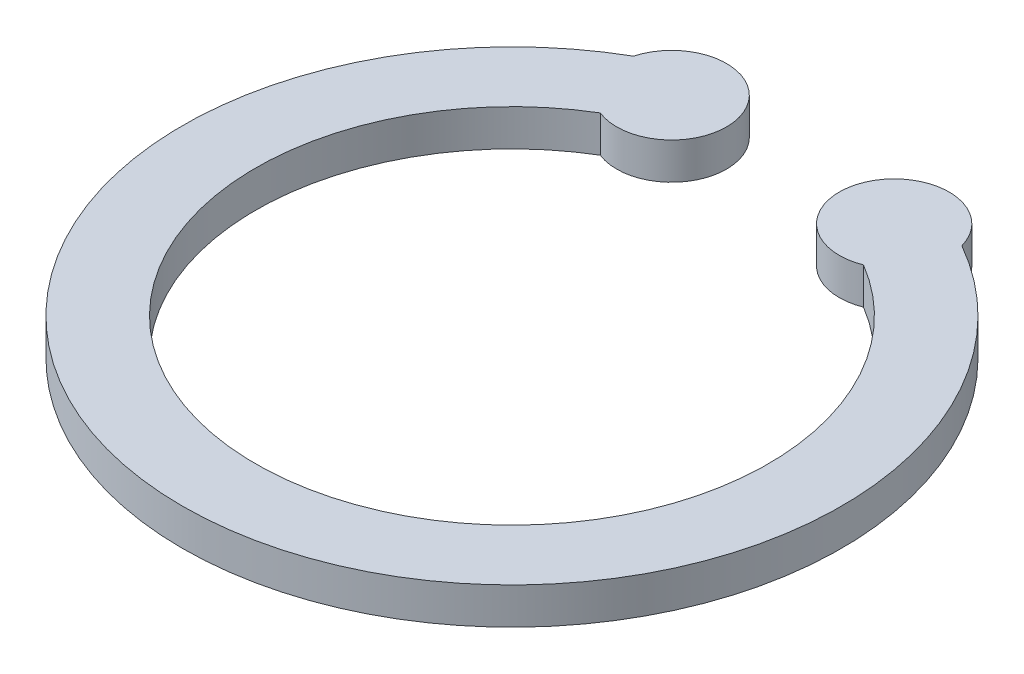
ISO-10303-21;
HEADER;
FILE_DESCRIPTION(('STEP AP214'),'2;1');
FILE_NAME('part.step','',(''),(''),'','','');
FILE_SCHEMA(('AUTOMOTIVE_DESIGN { 1 0 10303 214 1 1 1 1 }'));
ENDSEC;
DATA;
#1=APPLICATION_CONTEXT('core data for automotive mechanical design processes');
#2=APPLICATION_PROTOCOL_DEFINITION('international standard','automotive_design',2000,#1);
#3=PRODUCT_CONTEXT('',#1,'mechanical');
#4=PRODUCT('Part','Part','',(#3));
#5=PRODUCT_RELATED_PRODUCT_CATEGORY('part','',(#4));
#6=PRODUCT_DEFINITION_FORMATION('','',#4);
#7=PRODUCT_DEFINITION_CONTEXT('part definition',#1,'design');
#8=PRODUCT_DEFINITION('design','',#6,#7);
#9=PRODUCT_DEFINITION_SHAPE('','',#8);
#10=(LENGTH_UNIT() NAMED_UNIT(*) SI_UNIT(.MILLI.,.METRE.));
#11=(NAMED_UNIT(*) PLANE_ANGLE_UNIT() SI_UNIT($,.RADIAN.));
#12=(NAMED_UNIT(*) SI_UNIT($,.STERADIAN.) SOLID_ANGLE_UNIT());
#13=UNCERTAINTY_MEASURE_WITH_UNIT(LENGTH_MEASURE(1.E-05),#10,'distance_accuracy_value','');
#14=(GEOMETRIC_REPRESENTATION_CONTEXT(3) GLOBAL_UNCERTAINTY_ASSIGNED_CONTEXT((#13)) GLOBAL_UNIT_ASSIGNED_CONTEXT((#10,
#11,#12)) REPRESENTATION_CONTEXT('',''));
#15=CARTESIAN_POINT('',(0.,0.,0.));
#16=DIRECTION('',(0.,0.,1.));
#17=DIRECTION('',(1.,0.,0.));
#18=AXIS2_PLACEMENT_3D('',#15,#16,#17);
#19=CARTESIAN_POINT('',(-1.5195527568934,0.5,-3.70012964894714));
#20=DIRECTION('',(0.,-1.,0.));
#21=DIRECTION('',(0.,0.,-1.));
#22=AXIS2_PLACEMENT_3D('',#19,#20,#21);
#23=CYLINDRICAL_SURFACE('',#22,0.75);
#24=CARTESIAN_POINT('',(-1.5195527568934,0.,-3.70012964894714));
#25=DIRECTION('',(0.,1.,0.));
#26=DIRECTION('',(0.,0.,1.));
#27=AXIS2_PLACEMENT_3D('',#24,#25,#26);
#28=CIRCLE('',#27,0.75);
#29=CARTESIAN_POINT('',(-1.79712877821287,0.,-3.00338611479096));
#30=VERTEX_POINT('',#29);
#31=CARTESIAN_POINT('',(-2.24194265383014,0.,-3.9017551354406));
#32=VERTEX_POINT('',#31);
#33=EDGE_CURVE('E113',#30,#32,#28,.T.);
#34=ORIENTED_EDGE('',*,*,#33,.T.);
#35=DIRECTION('',(0.,-1.,0.));
#36=VECTOR('',#35,1.);
#37=CARTESIAN_POINT('',(-2.24194265383014,0.5,-3.9017551354406));
#38=LINE('',#37,#36);
#39=CARTESIAN_POINT('',(-2.24194265383014,0.5,-3.9017551354406));
#40=VERTEX_POINT('',#39);
#41=EDGE_CURVE('E11',#40,#32,#38,.T.);
#42=ORIENTED_EDGE('',*,*,#41,.F.);
#43=CARTESIAN_POINT('',(-1.5195527568934,0.5,-3.70012964894714));
#44=DIRECTION('',(0.,1.,0.));
#45=DIRECTION('',(0.,0.,1.));
#46=AXIS2_PLACEMENT_3D('',#43,#44,#45);
#47=CIRCLE('',#46,0.75);
#48=CARTESIAN_POINT('',(-1.79712877821287,0.5,-3.00338611479096));
#49=VERTEX_POINT('',#48);
#50=EDGE_CURVE('E97',#49,#40,#47,.T.);
#51=ORIENTED_EDGE('',*,*,#50,.F.);
#52=DIRECTION('',(0.,-1.,0.));
#53=VECTOR('',#52,1.);
#54=CARTESIAN_POINT('',(-1.79712877821287,0.5,-3.00338611479096));
#55=LINE('',#54,#53);
#56=EDGE_CURVE('E109',#49,#30,#55,.T.);
#57=ORIENTED_EDGE('',*,*,#56,.T.);
#58=EDGE_LOOP('',(#34,#42,#51,#57));
#59=FACE_BOUND('',#58,.T.);
#60=ADVANCED_FACE('F45',(#59),#23,.T.);
#61=CARTESIAN_POINT('',(0.,0.5,0.));
#62=DIRECTION('',(0.,-1.,0.));
#63=DIRECTION('',(0.,0.,-1.));
#64=AXIS2_PLACEMENT_3D('',#61,#62,#63);
#65=CYLINDRICAL_SURFACE('',#64,4.5);
#66=CARTESIAN_POINT('',(0.,0.,0.));
#67=DIRECTION('',(0.,1.,0.));
#68=DIRECTION('',(0.,0.,1.));
#69=AXIS2_PLACEMENT_3D('',#66,#67,#68);
#70=CIRCLE('',#69,4.5);
#71=CARTESIAN_POINT('',(2.24194265383014,0.,-3.9017551354406));
#72=VERTEX_POINT('',#71);
#73=EDGE_CURVE('E102',#32,#72,#70,.T.);
#74=ORIENTED_EDGE('',*,*,#73,.T.);
#75=DIRECTION('',(0.,-1.,0.));
#76=VECTOR('',#75,1.);
#77=CARTESIAN_POINT('',(2.24194265383014,0.5,-3.9017551354406));
#78=LINE('',#77,#76);
#79=CARTESIAN_POINT('',(2.24194265383014,0.5,-3.9017551354406));
#80=VERTEX_POINT('',#79);
#81=EDGE_CURVE('E54',#80,#72,#78,.T.);
#82=ORIENTED_EDGE('',*,*,#81,.F.);
#83=CARTESIAN_POINT('',(0.,0.5,0.));
#84=DIRECTION('',(0.,1.,0.));
#85=DIRECTION('',(0.,0.,1.));
#86=AXIS2_PLACEMENT_3D('',#83,#84,#85);
#87=CIRCLE('',#86,4.5);
#88=EDGE_CURVE('E92',#40,#80,#87,.T.);
#89=ORIENTED_EDGE('',*,*,#88,.F.);
#90=ORIENTED_EDGE('',*,*,#41,.T.);
#91=EDGE_LOOP('',(#74,#82,#89,#90));
#92=FACE_BOUND('',#91,.T.);
#93=ADVANCED_FACE('F101',(#92),#65,.T.);
#94=CARTESIAN_POINT('',(1.5195527568934,0.5,-3.70012964894714));
#95=DIRECTION('',(0.,-1.,0.));
#96=DIRECTION('',(0.,0.,-1.));
#97=AXIS2_PLACEMENT_3D('',#94,#95,#96);
#98=CYLINDRICAL_SURFACE('',#97,0.75);
#99=CARTESIAN_POINT('',(1.5195527568934,0.,-3.70012964894714));
#100=DIRECTION('',(0.,1.,0.));
#101=DIRECTION('',(0.,0.,1.));
#102=AXIS2_PLACEMENT_3D('',#99,#100,#101);
#103=CIRCLE('',#102,0.75);
#104=CARTESIAN_POINT('',(1.79712877821287,0.,-3.00338611479095));
#105=VERTEX_POINT('',#104);
#106=EDGE_CURVE('E79',#72,#105,#103,.T.);
#107=ORIENTED_EDGE('',*,*,#106,.T.);
#108=DIRECTION('',(0.,-1.,0.));
#109=VECTOR('',#108,1.);
#110=CARTESIAN_POINT('',(1.79712877821287,0.5,-3.00338611479095));
#111=LINE('',#110,#109);
#112=CARTESIAN_POINT('',(1.79712877821287,0.5,-3.00338611479095));
#113=VERTEX_POINT('',#112);
#114=EDGE_CURVE('E104',#113,#105,#111,.T.);
#115=ORIENTED_EDGE('',*,*,#114,.F.);
#116=CARTESIAN_POINT('',(1.5195527568934,0.5,-3.70012964894714));
#117=DIRECTION('',(0.,1.,0.));
#118=DIRECTION('',(0.,0.,1.));
#119=AXIS2_PLACEMENT_3D('',#116,#117,#118);
#120=CIRCLE('',#119,0.75);
#121=EDGE_CURVE('E95',#80,#113,#120,.T.);
#122=ORIENTED_EDGE('',*,*,#121,.F.);
#123=ORIENTED_EDGE('',*,*,#81,.T.);
#124=EDGE_LOOP('',(#107,#115,#122,#123));
#125=FACE_BOUND('',#124,.T.);
#126=ADVANCED_FACE('F105',(#125),#98,.T.);
#127=CARTESIAN_POINT('',(0.,0.5,0.));
#128=DIRECTION('',(0.,-1.,0.));
#129=DIRECTION('',(0.,0.,-1.));
#130=AXIS2_PLACEMENT_3D('',#127,#128,#129);
#131=CYLINDRICAL_SURFACE('',#130,3.5);
#132=CARTESIAN_POINT('',(0.,0.,0.));
#133=DIRECTION('',(0.,-1.,0.));
#134=DIRECTION('',(0.,0.,1.));
#135=AXIS2_PLACEMENT_3D('',#132,#133,#134);
#136=CIRCLE('',#135,3.5);
#137=EDGE_CURVE('E85',#105,#30,#136,.T.);
#138=ORIENTED_EDGE('',*,*,#137,.T.);
#139=ORIENTED_EDGE('',*,*,#56,.F.);
#140=CARTESIAN_POINT('',(0.,0.5,0.));
#141=DIRECTION('',(0.,-1.,0.));
#142=DIRECTION('',(0.,0.,1.));
#143=AXIS2_PLACEMENT_3D('',#140,#141,#142);
#144=CIRCLE('',#143,3.5);
#145=EDGE_CURVE('E62',#113,#49,#144,.T.);
#146=ORIENTED_EDGE('',*,*,#145,.F.);
#147=ORIENTED_EDGE('',*,*,#114,.T.);
#148=EDGE_LOOP('',(#138,#139,#146,#147));
#149=FACE_BOUND('',#148,.T.);
#150=ADVANCED_FACE('F126',(#149),#131,.F.);
#151=CARTESIAN_POINT('',(-0.759776378446699,0.5,-1.85006482447357));
#152=DIRECTION('',(0.,1.,0.));
#153=DIRECTION('',(0.,0.,1.));
#154=AXIS2_PLACEMENT_3D('',#151,#152,#153);
#155=PLANE('',#154);
#156=ORIENTED_EDGE('',*,*,#50,.T.);
#157=ORIENTED_EDGE('',*,*,#88,.T.);
#158=ORIENTED_EDGE('',*,*,#121,.T.);
#159=ORIENTED_EDGE('',*,*,#145,.T.);
#160=EDGE_LOOP('',(#156,#157,#158,#159));
#161=FACE_BOUND('',#160,.T.);
#162=ADVANCED_FACE('F93',(#161),#155,.T.);
#163=CARTESIAN_POINT('',(-0.759776378446699,0.,-1.85006482447357));
#164=DIRECTION('',(0.,1.,0.));
#165=DIRECTION('',(0.,0.,1.));
#166=AXIS2_PLACEMENT_3D('',#163,#164,#165);
#167=PLANE('',#166);
#168=ORIENTED_EDGE('',*,*,#33,.F.);
#169=ORIENTED_EDGE('',*,*,#137,.F.);
#170=ORIENTED_EDGE('',*,*,#106,.F.);
#171=ORIENTED_EDGE('',*,*,#73,.F.);
#172=EDGE_LOOP('',(#168,#169,#170,#171));
#173=FACE_BOUND('',#172,.T.);
#174=ADVANCED_FACE('F129',(#173),#167,.F.);
#175=CLOSED_SHELL('',(#60,#93,#126,#150,#162,#174));
#176=MANIFOLD_SOLID_BREP('B2',#175);
#177=ADVANCED_BREP_SHAPE_REPRESENTATION('',(#18,#176),#14);
#178=SHAPE_DEFINITION_REPRESENTATION(#9,#177);
ENDSEC;
END-ISO-10303-21;
